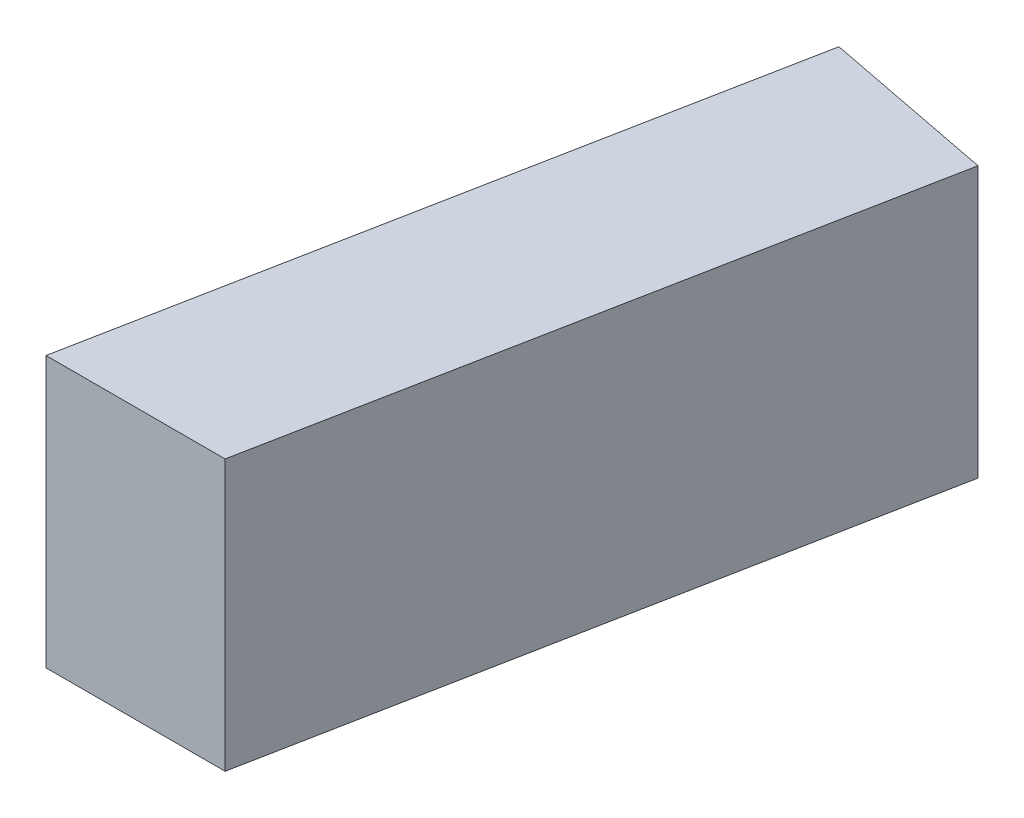
ISO-10303-21;
HEADER;
FILE_DESCRIPTION(('STEP AP214'),'2;1');
FILE_NAME('part.step','',(''),(''),'','','');
FILE_SCHEMA(('AUTOMOTIVE_DESIGN { 1 0 10303 214 1 1 1 1 }'));
ENDSEC;
DATA;
#1=APPLICATION_CONTEXT('core data for automotive mechanical design processes');
#2=APPLICATION_PROTOCOL_DEFINITION('international standard','automotive_design',2000,#1);
#3=PRODUCT_CONTEXT('',#1,'mechanical');
#4=PRODUCT('Part','Part','',(#3));
#5=PRODUCT_RELATED_PRODUCT_CATEGORY('part','',(#4));
#6=PRODUCT_DEFINITION_FORMATION('','',#4);
#7=PRODUCT_DEFINITION_CONTEXT('part definition',#1,'design');
#8=PRODUCT_DEFINITION('design','',#6,#7);
#9=PRODUCT_DEFINITION_SHAPE('','',#8);
#10=(LENGTH_UNIT() NAMED_UNIT(*) SI_UNIT(.MILLI.,.METRE.));
#11=(NAMED_UNIT(*) PLANE_ANGLE_UNIT() SI_UNIT($,.RADIAN.));
#12=(NAMED_UNIT(*) SI_UNIT($,.STERADIAN.) SOLID_ANGLE_UNIT());
#13=UNCERTAINTY_MEASURE_WITH_UNIT(LENGTH_MEASURE(1.E-05),#10,'distance_accuracy_value','');
#14=(GEOMETRIC_REPRESENTATION_CONTEXT(3) GLOBAL_UNCERTAINTY_ASSIGNED_CONTEXT((#13)) GLOBAL_UNIT_ASSIGNED_CONTEXT((#10,
#11,#12)) REPRESENTATION_CONTEXT('',''));
#15=CARTESIAN_POINT('',(0.,0.,0.));
#16=DIRECTION('',(0.,0.,1.));
#17=DIRECTION('',(1.,0.,0.));
#18=AXIS2_PLACEMENT_3D('',#15,#16,#17);
#19=CARTESIAN_POINT('',(6.6216585172089,-5.,0.));
#20=DIRECTION('',(0.,0.,1.));
#21=DIRECTION('',(1.,0.,0.));
#22=AXIS2_PLACEMENT_3D('',#19,#20,#21);
#23=PLANE('',#22);
#24=DIRECTION('',(0.,1.,0.));
#25=VECTOR('',#24,1.);
#26=CARTESIAN_POINT('',(6.6216585172089,-5.,0.));
#27=LINE('',#26,#25);
#28=CARTESIAN_POINT('',(6.6216585172089,-5.,0.));
#29=VERTEX_POINT('',#28);
#30=CARTESIAN_POINT('',(6.6216585172089,5.,0.));
#31=VERTEX_POINT('',#30);
#32=EDGE_CURVE('E42',#29,#31,#27,.T.);
#33=ORIENTED_EDGE('',*,*,#32,.T.);
#34=DIRECTION('',(1.,0.,0.));
#35=VECTOR('',#34,1.);
#36=CARTESIAN_POINT('',(6.6216585172089,5.,0.));
#37=LINE('',#36,#35);
#38=CARTESIAN_POINT('',(0.,5.,0.));
#39=VERTEX_POINT('',#38);
#40=EDGE_CURVE('E79',#39,#31,#37,.T.);
#41=ORIENTED_EDGE('',*,*,#40,.F.);
#42=DIRECTION('',(0.,1.,0.));
#43=VECTOR('',#42,1.);
#44=CARTESIAN_POINT('',(0.,-5.,0.));
#45=LINE('',#44,#43);
#46=CARTESIAN_POINT('',(0.,-5.,0.));
#47=VERTEX_POINT('',#46);
#48=EDGE_CURVE('E11',#47,#39,#45,.T.);
#49=ORIENTED_EDGE('',*,*,#48,.F.);
#50=DIRECTION('',(1.,0.,0.));
#51=VECTOR('',#50,1.);
#52=CARTESIAN_POINT('',(6.6216585172089,-5.,0.));
#53=LINE('',#52,#51);
#54=EDGE_CURVE('E80',#47,#29,#53,.T.);
#55=ORIENTED_EDGE('',*,*,#54,.T.);
#56=EDGE_LOOP('',(#33,#41,#49,#55));
#57=FACE_BOUND('',#56,.T.);
#58=ADVANCED_FACE('F39',(#57),#23,.T.);
#59=CARTESIAN_POINT('',(0.,-5.,0.));
#60=DIRECTION('',(-0.981627183447663,0.,-0.190808995376549));
#61=DIRECTION('',(-0.190808995376549,0.,0.981627183447663));
#62=AXIS2_PLACEMENT_3D('',#59,#60,#61);
#63=PLANE('',#62);
#64=ORIENTED_EDGE('',*,*,#48,.T.);
#65=DIRECTION('',(-0.190808995376549,0.,0.981627183447663));
#66=VECTOR('',#65,1.);
#67=CARTESIAN_POINT('',(0.,5.,0.));
#68=LINE('',#67,#66);
#69=CARTESIAN_POINT('',(4.77022488441372,5.,-24.5406795861916));
#70=VERTEX_POINT('',#69);
#71=EDGE_CURVE('E96',#70,#39,#68,.T.);
#72=ORIENTED_EDGE('',*,*,#71,.F.);
#73=DIRECTION('',(0.,1.,0.));
#74=VECTOR('',#73,1.);
#75=CARTESIAN_POINT('',(4.77022488441372,-5.,-24.5406795861916));
#76=LINE('',#75,#74);
#77=CARTESIAN_POINT('',(4.77022488441372,-5.,-24.5406795861916));
#78=VERTEX_POINT('',#77);
#79=EDGE_CURVE('E47',#78,#70,#76,.T.);
#80=ORIENTED_EDGE('',*,*,#79,.F.);
#81=DIRECTION('',(-0.190808995376549,0.,0.981627183447663));
#82=VECTOR('',#81,1.);
#83=CARTESIAN_POINT('',(0.,-5.,0.));
#84=LINE('',#83,#82);
#85=EDGE_CURVE('E85',#78,#47,#84,.T.);
#86=ORIENTED_EDGE('',*,*,#85,.T.);
#87=EDGE_LOOP('',(#64,#72,#80,#86));
#88=FACE_BOUND('',#87,.T.);
#89=ADVANCED_FACE('F111',(#88),#63,.T.);
#90=CARTESIAN_POINT('',(4.77022488441372,-5.,-24.5406795861916));
#91=DIRECTION('',(0.190808995376548,0.,-0.981627183447663));
#92=DIRECTION('',(-0.981627183447663,0.,-0.190808995376548));
#93=AXIS2_PLACEMENT_3D('',#90,#91,#92);
#94=PLANE('',#93);
#95=ORIENTED_EDGE('',*,*,#79,.T.);
#96=DIRECTION('',(-0.981627183447663,0.,-0.190808995376548));
#97=VECTOR('',#96,1.);
#98=CARTESIAN_POINT('',(4.77022488441372,5.,-24.5406795861916));
#99=LINE('',#98,#97);
#100=CARTESIAN_POINT('',(11.1508015768235,5.,-23.300421116244));
#101=VERTEX_POINT('',#100);
#102=EDGE_CURVE('E92',#101,#70,#99,.T.);
#103=ORIENTED_EDGE('',*,*,#102,.F.);
#104=DIRECTION('',(0.,1.,0.));
#105=VECTOR('',#104,1.);
#106=CARTESIAN_POINT('',(11.1508015768235,-5.,-23.300421116244));
#107=LINE('',#106,#105);
#108=CARTESIAN_POINT('',(11.1508015768235,-5.,-23.300421116244));
#109=VERTEX_POINT('',#108);
#110=EDGE_CURVE('E84',#109,#101,#107,.T.);
#111=ORIENTED_EDGE('',*,*,#110,.F.);
#112=DIRECTION('',(-0.981627183447663,0.,-0.190808995376548));
#113=VECTOR('',#112,1.);
#114=CARTESIAN_POINT('',(4.77022488441372,-5.,-24.5406795861916));
#115=LINE('',#114,#113);
#116=EDGE_CURVE('E104',#109,#78,#115,.T.);
#117=ORIENTED_EDGE('',*,*,#116,.T.);
#118=EDGE_LOOP('',(#95,#103,#111,#117));
#119=FACE_BOUND('',#118,.T.);
#120=ADVANCED_FACE('F108',(#119),#94,.T.);
#121=CARTESIAN_POINT('',(11.1508015768235,-5.,-23.300421116244));
#122=DIRECTION('',(0.981627183447663,0.,0.190808995376548));
#123=DIRECTION('',(0.190808995376548,0.,-0.981627183447663));
#124=AXIS2_PLACEMENT_3D('',#121,#122,#123);
#125=PLANE('',#124);
#126=ORIENTED_EDGE('',*,*,#110,.T.);
#127=DIRECTION('',(0.190808995376548,0.,-0.981627183447663));
#128=VECTOR('',#127,1.);
#129=CARTESIAN_POINT('',(11.1508015768235,5.,-23.300421116244));
#130=LINE('',#129,#128);
#131=EDGE_CURVE('E87',#31,#101,#130,.T.);
#132=ORIENTED_EDGE('',*,*,#131,.F.);
#133=ORIENTED_EDGE('',*,*,#32,.F.);
#134=DIRECTION('',(0.190808995376548,0.,-0.981627183447663));
#135=VECTOR('',#134,1.);
#136=CARTESIAN_POINT('',(11.1508015768235,-5.,-23.300421116244));
#137=LINE('',#136,#135);
#138=EDGE_CURVE('E102',#29,#109,#137,.T.);
#139=ORIENTED_EDGE('',*,*,#138,.T.);
#140=EDGE_LOOP('',(#126,#132,#133,#139));
#141=FACE_BOUND('',#140,.T.);
#142=ADVANCED_FACE('F88',(#141),#125,.T.);
#143=CARTESIAN_POINT('',(0.,-5.,0.));
#144=DIRECTION('',(0.,-1.,0.));
#145=DIRECTION('',(0.,0.,-1.));
#146=AXIS2_PLACEMENT_3D('',#143,#144,#145);
#147=PLANE('',#146);
#148=ORIENTED_EDGE('',*,*,#54,.F.);
#149=ORIENTED_EDGE('',*,*,#85,.F.);
#150=ORIENTED_EDGE('',*,*,#116,.F.);
#151=ORIENTED_EDGE('',*,*,#138,.F.);
#152=EDGE_LOOP('',(#148,#149,#150,#151));
#153=FACE_BOUND('',#152,.T.);
#154=ADVANCED_FACE('F113',(#153),#147,.T.);
#155=CARTESIAN_POINT('',(0.,5.,0.));
#156=DIRECTION('',(0.,-1.,0.));
#157=DIRECTION('',(0.,0.,-1.));
#158=AXIS2_PLACEMENT_3D('',#155,#156,#157);
#159=PLANE('',#158);
#160=ORIENTED_EDGE('',*,*,#40,.T.);
#161=ORIENTED_EDGE('',*,*,#131,.T.);
#162=ORIENTED_EDGE('',*,*,#102,.T.);
#163=ORIENTED_EDGE('',*,*,#71,.T.);
#164=EDGE_LOOP('',(#160,#161,#162,#163));
#165=FACE_BOUND('',#164,.T.);
#166=ADVANCED_FACE('F95',(#165),#159,.F.);
#167=CLOSED_SHELL('',(#58,#89,#120,#142,#154,#166));
#168=MANIFOLD_SOLID_BREP('B2',#167);
#169=ADVANCED_BREP_SHAPE_REPRESENTATION('',(#18,#168),#14);
#170=SHAPE_DEFINITION_REPRESENTATION(#9,#169);
ENDSEC;
END-ISO-10303-21;
